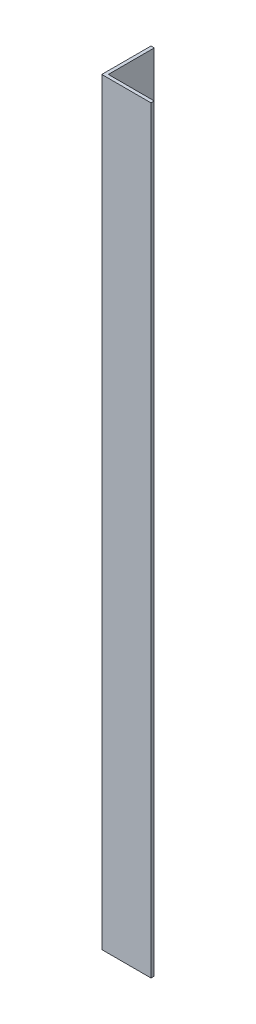
ISO-10303-21;
HEADER;
FILE_DESCRIPTION(('STEP AP214'),'2;1');
FILE_NAME('part.step','',(''),(''),'','','');
FILE_SCHEMA(('AUTOMOTIVE_DESIGN { 1 0 10303 214 1 1 1 1 }'));
ENDSEC;
DATA;
#1=APPLICATION_CONTEXT('core data for automotive mechanical design processes');
#2=APPLICATION_PROTOCOL_DEFINITION('international standard','automotive_design',2000,#1);
#3=PRODUCT_CONTEXT('',#1,'mechanical');
#4=PRODUCT('Part','Part','',(#3));
#5=PRODUCT_RELATED_PRODUCT_CATEGORY('part','',(#4));
#6=PRODUCT_DEFINITION_FORMATION('','',#4);
#7=PRODUCT_DEFINITION_CONTEXT('part definition',#1,'design');
#8=PRODUCT_DEFINITION('design','',#6,#7);
#9=PRODUCT_DEFINITION_SHAPE('','',#8);
#10=(LENGTH_UNIT() NAMED_UNIT(*) SI_UNIT(.MILLI.,.METRE.));
#11=(NAMED_UNIT(*) PLANE_ANGLE_UNIT() SI_UNIT($,.RADIAN.));
#12=(NAMED_UNIT(*) SI_UNIT($,.STERADIAN.) SOLID_ANGLE_UNIT());
#13=UNCERTAINTY_MEASURE_WITH_UNIT(LENGTH_MEASURE(1.E-05),#10,'distance_accuracy_value','');
#14=(GEOMETRIC_REPRESENTATION_CONTEXT(3) GLOBAL_UNCERTAINTY_ASSIGNED_CONTEXT((#13)) GLOBAL_UNIT_ASSIGNED_CONTEXT((#10,
#11,#12)) REPRESENTATION_CONTEXT('',''));
#15=CARTESIAN_POINT('',(0.,0.,0.));
#16=DIRECTION('',(0.,0.,1.));
#17=DIRECTION('',(1.,0.,0.));
#18=AXIS2_PLACEMENT_3D('',#15,#16,#17);
#19=CARTESIAN_POINT('',(15.,231.,0.));
#20=DIRECTION('',(0.,0.,-1.));
#21=DIRECTION('',(-1.,0.,0.));
#22=AXIS2_PLACEMENT_3D('',#19,#20,#21);
#23=PLANE('',#22);
#24=DIRECTION('',(1.,0.,0.));
#25=VECTOR('',#24,1.);
#26=CARTESIAN_POINT('',(15.,0.,0.));
#27=LINE('',#26,#25);
#28=CARTESIAN_POINT('',(0.,0.,0.));
#29=VERTEX_POINT('',#28);
#30=CARTESIAN_POINT('',(15.,0.,0.));
#31=VERTEX_POINT('',#30);
#32=EDGE_CURVE('E121',#29,#31,#27,.T.);
#33=ORIENTED_EDGE('',*,*,#32,.T.);
#34=DIRECTION('',(0.,-1.,0.));
#35=VECTOR('',#34,1.);
#36=CARTESIAN_POINT('',(15.,231.,0.));
#37=LINE('',#36,#35);
#38=CARTESIAN_POINT('',(15.,231.,0.));
#39=VERTEX_POINT('',#38);
#40=EDGE_CURVE('E11',#39,#31,#37,.T.);
#41=ORIENTED_EDGE('',*,*,#40,.F.);
#42=DIRECTION('',(1.,0.,0.));
#43=VECTOR('',#42,1.);
#44=CARTESIAN_POINT('',(15.,231.,0.));
#45=LINE('',#44,#43);
#46=CARTESIAN_POINT('',(0.,231.,0.));
#47=VERTEX_POINT('',#46);
#48=EDGE_CURVE('E131',#47,#39,#45,.T.);
#49=ORIENTED_EDGE('',*,*,#48,.F.);
#50=DIRECTION('',(0.,-1.,0.));
#51=VECTOR('',#50,1.);
#52=CARTESIAN_POINT('',(0.,231.,0.));
#53=LINE('',#52,#51);
#54=EDGE_CURVE('E117',#47,#29,#53,.T.);
#55=ORIENTED_EDGE('',*,*,#54,.T.);
#56=EDGE_LOOP('',(#33,#41,#49,#55));
#57=FACE_BOUND('',#56,.T.);
#58=ADVANCED_FACE('F37',(#57),#23,.F.);
#59=CARTESIAN_POINT('',(15.,231.,-0.999999999999998));
#60=DIRECTION('',(-1.,0.,0.));
#61=DIRECTION('',(0.,0.,1.));
#62=AXIS2_PLACEMENT_3D('',#59,#60,#61);
#63=PLANE('',#62);
#64=DIRECTION('',(0.,0.,-1.));
#65=VECTOR('',#64,1.);
#66=CARTESIAN_POINT('',(15.,0.,-0.999999999999998));
#67=LINE('',#66,#65);
#68=CARTESIAN_POINT('',(15.,0.,-0.999999999999998));
#69=VERTEX_POINT('',#68);
#70=EDGE_CURVE('E124',#31,#69,#67,.T.);
#71=ORIENTED_EDGE('',*,*,#70,.T.);
#72=DIRECTION('',(0.,-1.,0.));
#73=VECTOR('',#72,1.);
#74=CARTESIAN_POINT('',(15.,231.,-0.999999999999998));
#75=LINE('',#74,#73);
#76=CARTESIAN_POINT('',(15.,231.,-0.999999999999998));
#77=VERTEX_POINT('',#76);
#78=EDGE_CURVE('E45',#77,#69,#75,.T.);
#79=ORIENTED_EDGE('',*,*,#78,.F.);
#80=DIRECTION('',(0.,0.,-1.));
#81=VECTOR('',#80,1.);
#82=CARTESIAN_POINT('',(15.,231.,-0.999999999999998));
#83=LINE('',#82,#81);
#84=EDGE_CURVE('E90',#39,#77,#83,.T.);
#85=ORIENTED_EDGE('',*,*,#84,.F.);
#86=ORIENTED_EDGE('',*,*,#40,.T.);
#87=EDGE_LOOP('',(#71,#79,#85,#86));
#88=FACE_BOUND('',#87,.T.);
#89=ADVANCED_FACE('F155',(#88),#63,.F.);
#90=CARTESIAN_POINT('',(1.,231.,-0.999999999999997));
#91=DIRECTION('',(0.,0.,1.));
#92=DIRECTION('',(1.,0.,0.));
#93=AXIS2_PLACEMENT_3D('',#90,#91,#92);
#94=PLANE('',#93);
#95=DIRECTION('',(-1.,0.,0.));
#96=VECTOR('',#95,1.);
#97=CARTESIAN_POINT('',(1.,0.,-0.999999999999997));
#98=LINE('',#97,#96);
#99=CARTESIAN_POINT('',(1.,0.,-0.999999999999997));
#100=VERTEX_POINT('',#99);
#101=EDGE_CURVE('E126',#69,#100,#98,.T.);
#102=ORIENTED_EDGE('',*,*,#101,.T.);
#103=DIRECTION('',(0.,-1.,0.));
#104=VECTOR('',#103,1.);
#105=CARTESIAN_POINT('',(1.,231.,-0.999999999999997));
#106=LINE('',#105,#104);
#107=CARTESIAN_POINT('',(1.,231.,-0.999999999999997));
#108=VERTEX_POINT('',#107);
#109=EDGE_CURVE('E112',#108,#100,#106,.T.);
#110=ORIENTED_EDGE('',*,*,#109,.F.);
#111=DIRECTION('',(-1.,0.,0.));
#112=VECTOR('',#111,1.);
#113=CARTESIAN_POINT('',(1.,231.,-0.999999999999997));
#114=LINE('',#113,#112);
#115=EDGE_CURVE('E103',#77,#108,#114,.T.);
#116=ORIENTED_EDGE('',*,*,#115,.F.);
#117=ORIENTED_EDGE('',*,*,#78,.T.);
#118=EDGE_LOOP('',(#102,#110,#116,#117));
#119=FACE_BOUND('',#118,.T.);
#120=ADVANCED_FACE('F137',(#119),#94,.F.);
#121=CARTESIAN_POINT('',(0.999999999999998,231.,-15.));
#122=DIRECTION('',(-1.,0.,0.));
#123=DIRECTION('',(0.,0.,1.));
#124=AXIS2_PLACEMENT_3D('',#121,#122,#123);
#125=PLANE('',#124);
#126=DIRECTION('',(0.,0.,-1.));
#127=VECTOR('',#126,1.);
#128=CARTESIAN_POINT('',(0.999999999999998,0.,-15.));
#129=LINE('',#128,#127);
#130=CARTESIAN_POINT('',(0.999999999999998,0.,-15.));
#131=VERTEX_POINT('',#130);
#132=EDGE_CURVE('E111',#100,#131,#129,.T.);
#133=ORIENTED_EDGE('',*,*,#132,.T.);
#134=DIRECTION('',(0.,-1.,0.));
#135=VECTOR('',#134,1.);
#136=CARTESIAN_POINT('',(0.999999999999998,231.,-15.));
#137=LINE('',#136,#135);
#138=CARTESIAN_POINT('',(0.999999999999998,231.,-15.));
#139=VERTEX_POINT('',#138);
#140=EDGE_CURVE('E108',#139,#131,#137,.T.);
#141=ORIENTED_EDGE('',*,*,#140,.F.);
#142=DIRECTION('',(0.,0.,-1.));
#143=VECTOR('',#142,1.);
#144=CARTESIAN_POINT('',(0.999999999999998,231.,-15.));
#145=LINE('',#144,#143);
#146=EDGE_CURVE('E97',#108,#139,#145,.T.);
#147=ORIENTED_EDGE('',*,*,#146,.F.);
#148=ORIENTED_EDGE('',*,*,#109,.T.);
#149=EDGE_LOOP('',(#133,#141,#147,#148));
#150=FACE_BOUND('',#149,.T.);
#151=ADVANCED_FACE('F109',(#150),#125,.F.);
#152=CARTESIAN_POINT('',(0.,231.,-15.));
#153=DIRECTION('',(0.,0.,1.));
#154=DIRECTION('',(1.,0.,0.));
#155=AXIS2_PLACEMENT_3D('',#152,#153,#154);
#156=PLANE('',#155);
#157=DIRECTION('',(-1.,0.,0.));
#158=VECTOR('',#157,1.);
#159=CARTESIAN_POINT('',(0.,0.,-15.));
#160=LINE('',#159,#158);
#161=CARTESIAN_POINT('',(0.,0.,-15.));
#162=VERTEX_POINT('',#161);
#163=EDGE_CURVE('E76',#131,#162,#160,.T.);
#164=ORIENTED_EDGE('',*,*,#163,.T.);
#165=DIRECTION('',(0.,-1.,0.));
#166=VECTOR('',#165,1.);
#167=CARTESIAN_POINT('',(0.,231.,-15.));
#168=LINE('',#167,#166);
#169=CARTESIAN_POINT('',(0.,231.,-15.));
#170=VERTEX_POINT('',#169);
#171=EDGE_CURVE('E113',#170,#162,#168,.T.);
#172=ORIENTED_EDGE('',*,*,#171,.F.);
#173=DIRECTION('',(-1.,0.,0.));
#174=VECTOR('',#173,1.);
#175=CARTESIAN_POINT('',(0.,231.,-15.));
#176=LINE('',#175,#174);
#177=EDGE_CURVE('E101',#139,#170,#176,.T.);
#178=ORIENTED_EDGE('',*,*,#177,.F.);
#179=ORIENTED_EDGE('',*,*,#140,.T.);
#180=EDGE_LOOP('',(#164,#172,#178,#179));
#181=FACE_BOUND('',#180,.T.);
#182=ADVANCED_FACE('F115',(#181),#156,.F.);
#183=CARTESIAN_POINT('',(0.,231.,0.));
#184=DIRECTION('',(1.,0.,0.));
#185=DIRECTION('',(0.,0.,-1.));
#186=AXIS2_PLACEMENT_3D('',#183,#184,#185);
#187=PLANE('',#186);
#188=DIRECTION('',(0.,0.,1.));
#189=VECTOR('',#188,1.);
#190=CARTESIAN_POINT('',(0.,0.,0.));
#191=LINE('',#190,#189);
#192=EDGE_CURVE('E82',#162,#29,#191,.T.);
#193=ORIENTED_EDGE('',*,*,#192,.T.);
#194=ORIENTED_EDGE('',*,*,#54,.F.);
#195=DIRECTION('',(0.,0.,1.));
#196=VECTOR('',#195,1.);
#197=CARTESIAN_POINT('',(0.,231.,0.));
#198=LINE('',#197,#196);
#199=EDGE_CURVE('E53',#170,#47,#198,.T.);
#200=ORIENTED_EDGE('',*,*,#199,.F.);
#201=ORIENTED_EDGE('',*,*,#171,.T.);
#202=EDGE_LOOP('',(#193,#194,#200,#201));
#203=FACE_BOUND('',#202,.T.);
#204=ADVANCED_FACE('F144',(#203),#187,.F.);
#205=CARTESIAN_POINT('',(0.,231.,0.));
#206=DIRECTION('',(0.,-1.,0.));
#207=DIRECTION('',(0.,0.,-1.));
#208=AXIS2_PLACEMENT_3D('',#205,#206,#207);
#209=PLANE('',#208);
#210=ORIENTED_EDGE('',*,*,#48,.T.);
#211=ORIENTED_EDGE('',*,*,#84,.T.);
#212=ORIENTED_EDGE('',*,*,#115,.T.);
#213=ORIENTED_EDGE('',*,*,#146,.T.);
#214=ORIENTED_EDGE('',*,*,#177,.T.);
#215=ORIENTED_EDGE('',*,*,#199,.T.);
#216=EDGE_LOOP('',(#210,#211,#212,#213,#214,#215));
#217=FACE_BOUND('',#216,.T.);
#218=ADVANCED_FACE('F99',(#217),#209,.F.);
#219=CARTESIAN_POINT('',(0.,0.,0.));
#220=DIRECTION('',(0.,-1.,0.));
#221=DIRECTION('',(0.,0.,-1.));
#222=AXIS2_PLACEMENT_3D('',#219,#220,#221);
#223=PLANE('',#222);
#224=ORIENTED_EDGE('',*,*,#32,.F.);
#225=ORIENTED_EDGE('',*,*,#192,.F.);
#226=ORIENTED_EDGE('',*,*,#163,.F.);
#227=ORIENTED_EDGE('',*,*,#132,.F.);
#228=ORIENTED_EDGE('',*,*,#101,.F.);
#229=ORIENTED_EDGE('',*,*,#70,.F.);
#230=EDGE_LOOP('',(#224,#225,#226,#227,#228,#229));
#231=FACE_BOUND('',#230,.T.);
#232=ADVANCED_FACE('F140',(#231),#223,.T.);
#233=CLOSED_SHELL('',(#58,#89,#120,#151,#182,#204,#218,#232));
#234=MANIFOLD_SOLID_BREP('B2',#233);
#235=ADVANCED_BREP_SHAPE_REPRESENTATION('',(#18,#234),#14);
#236=SHAPE_DEFINITION_REPRESENTATION(#9,#235);
ENDSEC;
END-ISO-10303-21;
